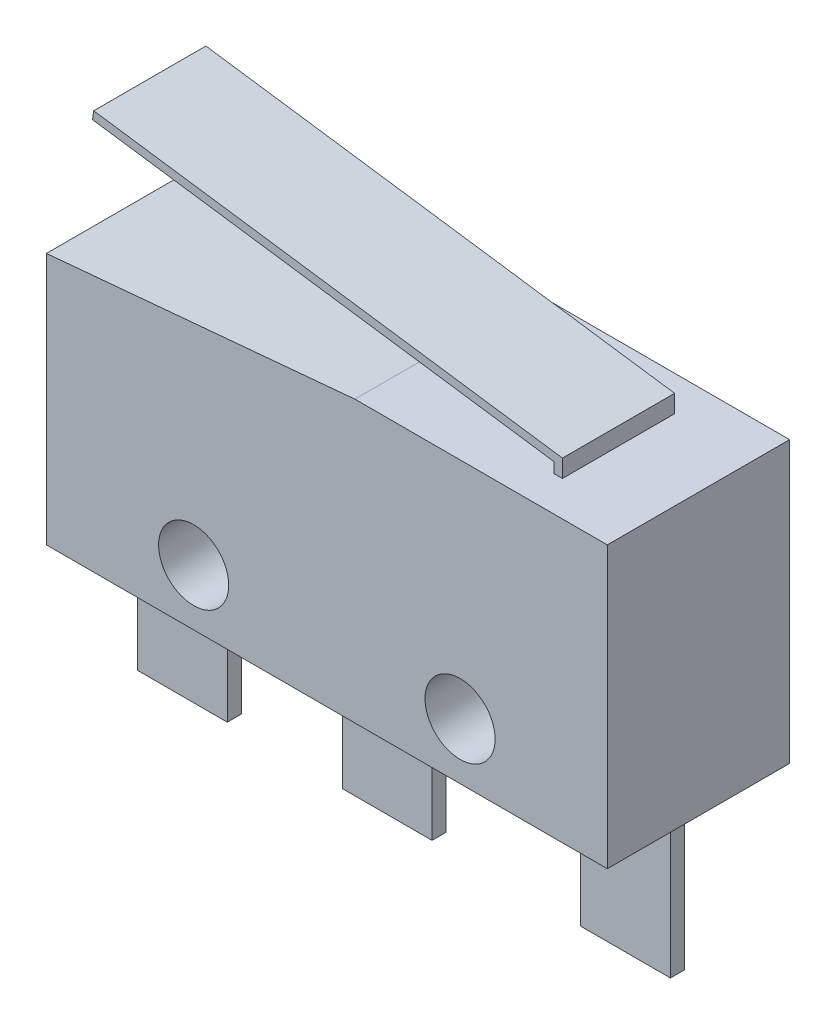
ISO-10303-21;
HEADER;
FILE_DESCRIPTION(('STEP AP214'),'2;1');
FILE_NAME('part.step','',(''),(''),'','','');
FILE_SCHEMA(('AUTOMOTIVE_DESIGN { 1 0 10303 214 1 1 1 1 }'));
ENDSEC;
DATA;
#1=APPLICATION_CONTEXT('core data for automotive mechanical design processes');
#2=APPLICATION_PROTOCOL_DEFINITION('international standard','automotive_design',2000,#1);
#3=PRODUCT_CONTEXT('',#1,'mechanical');
#4=PRODUCT('Part','Part','',(#3));
#5=PRODUCT_RELATED_PRODUCT_CATEGORY('part','',(#4));
#6=PRODUCT_DEFINITION_FORMATION('','',#4);
#7=PRODUCT_DEFINITION_CONTEXT('part definition',#1,'design');
#8=PRODUCT_DEFINITION('design','',#6,#7);
#9=PRODUCT_DEFINITION_SHAPE('','',#8);
#10=(LENGTH_UNIT() NAMED_UNIT(*) SI_UNIT(.MILLI.,.METRE.));
#11=(NAMED_UNIT(*) PLANE_ANGLE_UNIT() SI_UNIT($,.RADIAN.));
#12=(NAMED_UNIT(*) SI_UNIT($,.STERADIAN.) SOLID_ANGLE_UNIT());
#13=UNCERTAINTY_MEASURE_WITH_UNIT(LENGTH_MEASURE(1.E-05),#10,'distance_accuracy_value','');
#14=(GEOMETRIC_REPRESENTATION_CONTEXT(3) GLOBAL_UNCERTAINTY_ASSIGNED_CONTEXT((#13)) GLOBAL_UNIT_ASSIGNED_CONTEXT((#10,
#11,#12)) REPRESENTATION_CONTEXT('',''));
#15=CARTESIAN_POINT('',(0.,0.,0.));
#16=DIRECTION('',(0.,0.,1.));
#17=DIRECTION('',(1.,0.,0.));
#18=AXIS2_PLACEMENT_3D('',#15,#16,#17);
#19=CARTESIAN_POINT('',(-10.,10.,3.25));
#20=DIRECTION('',(0.,-1.,0.));
#21=DIRECTION('',(0.,0.,-1.));
#22=AXIS2_PLACEMENT_3D('',#19,#20,#21);
#23=PLANE('',#22);
#24=DIRECTION('',(1.,0.,0.));
#25=VECTOR('',#24,1.);
#26=CARTESIAN_POINT('',(2.00000000000001,10.,1.));
#27=LINE('',#26,#25);
#28=CARTESIAN_POINT('',(2.00000000000001,10.,1.));
#29=VERTEX_POINT('',#28);
#30=CARTESIAN_POINT('',(4.00000000000001,10.,1.));
#31=VERTEX_POINT('',#30);
#32=EDGE_CURVE('E401',#29,#31,#27,.T.);
#33=ORIENTED_EDGE('',*,*,#32,.F.);
#34=DIRECTION('',(0.,0.,-1.));
#35=VECTOR('',#34,1.);
#36=CARTESIAN_POINT('',(2.00000000000001,10.,1.));
#37=LINE('',#36,#35);
#38=CARTESIAN_POINT('',(2.00000000000001,10.,-1.));
#39=VERTEX_POINT('',#38);
#40=EDGE_CURVE('E421',#29,#39,#37,.T.);
#41=ORIENTED_EDGE('',*,*,#40,.T.);
#42=DIRECTION('',(1.,0.,0.));
#43=VECTOR('',#42,1.);
#44=CARTESIAN_POINT('',(2.00000000000001,10.,-1.));
#45=LINE('',#44,#43);
#46=CARTESIAN_POINT('',(4.00000000000001,10.,-1.));
#47=VERTEX_POINT('',#46);
#48=EDGE_CURVE('E409',#39,#47,#45,.T.);
#49=ORIENTED_EDGE('',*,*,#48,.T.);
#50=DIRECTION('',(0.,0.,-1.));
#51=VECTOR('',#50,1.);
#52=CARTESIAN_POINT('',(4.00000000000001,10.,1.));
#53=LINE('',#52,#51);
#54=EDGE_CURVE('E418',#31,#47,#53,.T.);
#55=ORIENTED_EDGE('',*,*,#54,.F.);
#56=EDGE_LOOP('',(#33,#41,#49,#55));
#57=FACE_BOUND('',#56,.T.);
#58=DIRECTION('',(-1.,0.,0.));
#59=VECTOR('',#58,1.);
#60=CARTESIAN_POINT('',(-10.,10.,-3.25));
#61=LINE('',#60,#59);
#62=CARTESIAN_POINT('',(10.,10.,-3.25));
#63=VERTEX_POINT('',#62);
#64=CARTESIAN_POINT('',(1.00000000000002,10.,-3.25));
#65=VERTEX_POINT('',#64);
#66=EDGE_CURVE('E438',#63,#65,#61,.T.);
#67=ORIENTED_EDGE('',*,*,#66,.T.);
#68=DIRECTION('',(0.,0.,1.));
#69=VECTOR('',#68,1.);
#70=CARTESIAN_POINT('',(1.00000000000001,10.,-3.25));
#71=LINE('',#70,#69);
#72=CARTESIAN_POINT('',(1.00000000000001,10.,3.25));
#73=VERTEX_POINT('',#72);
#74=EDGE_CURVE('E430',#65,#73,#71,.T.);
#75=ORIENTED_EDGE('',*,*,#74,.T.);
#76=DIRECTION('',(-1.,0.,0.));
#77=VECTOR('',#76,1.);
#78=CARTESIAN_POINT('',(-10.,10.,3.25));
#79=LINE('',#78,#77);
#80=CARTESIAN_POINT('',(10.,10.,3.25));
#81=VERTEX_POINT('',#80);
#82=EDGE_CURVE('E442',#81,#73,#79,.T.);
#83=ORIENTED_EDGE('',*,*,#82,.F.);
#84=DIRECTION('',(0.,0.,-1.));
#85=VECTOR('',#84,1.);
#86=CARTESIAN_POINT('',(10.,10.,3.25));
#87=LINE('',#86,#85);
#88=EDGE_CURVE('E445',#81,#63,#87,.T.);
#89=ORIENTED_EDGE('',*,*,#88,.T.);
#90=EDGE_LOOP('',(#67,#75,#83,#89));
#91=FACE_BOUND('',#90,.T.);
#92=DIRECTION('',(-1.,0.,0.));
#93=VECTOR('',#92,1.);
#94=CARTESIAN_POINT('',(7.15000000000001,10.,2.));
#95=LINE('',#94,#93);
#96=CARTESIAN_POINT('',(7.15000000000001,10.,2.));
#97=VERTEX_POINT('',#96);
#98=CARTESIAN_POINT('',(6.85000000000001,10.,2.));
#99=VERTEX_POINT('',#98);
#100=EDGE_CURVE('E256',#97,#99,#95,.T.);
#101=ORIENTED_EDGE('',*,*,#100,.T.);
#102=DIRECTION('',(0.,0.,-1.));
#103=VECTOR('',#102,1.);
#104=CARTESIAN_POINT('',(6.85000000000001,10.,2.));
#105=LINE('',#104,#103);
#106=CARTESIAN_POINT('',(6.85000000000001,10.,-2.));
#107=VERTEX_POINT('',#106);
#108=EDGE_CURVE('E276',#99,#107,#105,.T.);
#109=ORIENTED_EDGE('',*,*,#108,.T.);
#110=DIRECTION('',(-1.,0.,0.));
#111=VECTOR('',#110,1.);
#112=CARTESIAN_POINT('',(7.15000000000001,10.,-2.));
#113=LINE('',#112,#111);
#114=CARTESIAN_POINT('',(7.15000000000001,10.,-2.));
#115=VERTEX_POINT('',#114);
#116=EDGE_CURVE('E270',#115,#107,#113,.T.);
#117=ORIENTED_EDGE('',*,*,#116,.F.);
#118=DIRECTION('',(0.,0.,-1.));
#119=VECTOR('',#118,1.);
#120=CARTESIAN_POINT('',(7.15000000000001,10.,2.));
#121=LINE('',#120,#119);
#122=EDGE_CURVE('E274',#97,#115,#121,.T.);
#123=ORIENTED_EDGE('',*,*,#122,.F.);
#124=EDGE_LOOP('',(#101,#109,#117,#123));
#125=FACE_BOUND('',#124,.T.);
#126=ADVANCED_FACE('F33',(#57,#91,#125),#23,.F.);
#127=CARTESIAN_POINT('',(3.00000000000001,9.96666666666667,1.));
#128=DIRECTION('',(0.,0.,-1.));
#129=DIRECTION('',(-1.,0.,0.));
#130=AXIS2_PLACEMENT_3D('',#127,#128,#129);
#131=CYLINDRICAL_SURFACE('',#130,1.13333333333333);
#132=CARTESIAN_POINT('',(3.00000000000001,9.96666666666667,1.));
#133=DIRECTION('',(0.,0.,1.));
#134=DIRECTION('',(-1.,0.,0.));
#135=AXIS2_PLACEMENT_3D('',#132,#133,#134);
#136=CIRCLE('',#135,1.13333333333333);
#137=CARTESIAN_POINT('',(2.50381724234199,10.9856107845884,1.));
#138=VERTEX_POINT('',#137);
#139=CARTESIAN_POINT('',(2.00000000000001,10.5,1.));
#140=VERTEX_POINT('',#139);
#141=EDGE_CURVE('E395',#138,#140,#136,.T.);
#142=ORIENTED_EDGE('',*,*,#141,.F.);
#143=DIRECTION('',(0.,0.,-1.));
#144=VECTOR('',#143,1.);
#145=CARTESIAN_POINT('',(2.503817242342,10.9856107845884,1.));
#146=LINE('',#145,#144);
#147=CARTESIAN_POINT('',(2.50381724234199,10.9856107845884,-1.));
#148=VERTEX_POINT('',#147);
#149=EDGE_CURVE('E11',#138,#148,#146,.T.);
#150=ORIENTED_EDGE('',*,*,#149,.T.);
#151=CARTESIAN_POINT('',(3.00000000000001,9.96666666666667,-1.));
#152=DIRECTION('',(0.,0.,1.));
#153=DIRECTION('',(-1.,0.,0.));
#154=AXIS2_PLACEMENT_3D('',#151,#152,#153);
#155=CIRCLE('',#154,1.13333333333333);
#156=CARTESIAN_POINT('',(2.00000000000001,10.5,-1.));
#157=VERTEX_POINT('',#156);
#158=EDGE_CURVE('E388',#148,#157,#155,.T.);
#159=ORIENTED_EDGE('',*,*,#158,.T.);
#160=DIRECTION('',(0.,0.,-1.));
#161=VECTOR('',#160,1.);
#162=CARTESIAN_POINT('',(2.00000000000001,10.5,1.));
#163=LINE('',#162,#161);
#164=EDGE_CURVE('E406',#140,#157,#163,.T.);
#165=ORIENTED_EDGE('',*,*,#164,.F.);
#166=EDGE_LOOP('',(#142,#150,#159,#165));
#167=FACE_BOUND('',#166,.T.);
#168=ADVANCED_FACE('F480',(#167),#131,.T.);
#169=CARTESIAN_POINT('',(-10.,10.,3.25));
#170=DIRECTION('',(1.,0.,0.));
#171=DIRECTION('',(0.,1.,0.));
#172=AXIS2_PLACEMENT_3D('',#169,#170,#171);
#173=PLANE('',#172);
#174=DIRECTION('',(0.,-1.,0.));
#175=VECTOR('',#174,1.);
#176=CARTESIAN_POINT('',(-10.,10.,3.25));
#177=LINE('',#176,#175);
#178=CARTESIAN_POINT('',(-10.,9.,3.25));
#179=VERTEX_POINT('',#178);
#180=CARTESIAN_POINT('',(-10.,0.,3.25));
#181=VERTEX_POINT('',#180);
#182=EDGE_CURVE('E435',#179,#181,#177,.T.);
#183=ORIENTED_EDGE('',*,*,#182,.F.);
#184=DIRECTION('',(0.,0.,1.));
#185=VECTOR('',#184,1.);
#186=CARTESIAN_POINT('',(-10.,9.,-3.25));
#187=LINE('',#186,#185);
#188=CARTESIAN_POINT('',(-10.,9.,-3.25));
#189=VERTEX_POINT('',#188);
#190=EDGE_CURVE('E428',#189,#179,#187,.T.);
#191=ORIENTED_EDGE('',*,*,#190,.F.);
#192=DIRECTION('',(0.,-1.,0.));
#193=VECTOR('',#192,1.);
#194=CARTESIAN_POINT('',(-10.,10.,-3.25));
#195=LINE('',#194,#193);
#196=CARTESIAN_POINT('',(-10.,0.,-3.25));
#197=VERTEX_POINT('',#196);
#198=EDGE_CURVE('E433',#189,#197,#195,.T.);
#199=ORIENTED_EDGE('',*,*,#198,.T.);
#200=DIRECTION('',(0.,0.,-1.));
#201=VECTOR('',#200,1.);
#202=CARTESIAN_POINT('',(-10.,0.,3.25));
#203=LINE('',#202,#201);
#204=EDGE_CURVE('E458',#181,#197,#203,.T.);
#205=ORIENTED_EDGE('',*,*,#204,.F.);
#206=EDGE_LOOP('',(#183,#191,#199,#205));
#207=FACE_BOUND('',#206,.T.);
#208=ADVANCED_FACE('F35',(#207),#173,.F.);
#209=CARTESIAN_POINT('',(-10.,0.,3.25));
#210=DIRECTION('',(0.,1.,0.));
#211=DIRECTION('',(0.,0.,1.));
#212=AXIS2_PLACEMENT_3D('',#209,#210,#211);
#213=PLANE('',#212);
#214=DIRECTION('',(0.,0.,-1.));
#215=VECTOR('',#214,1.);
#216=CARTESIAN_POINT('',(-2.19999999999999,0.,0.5));
#217=LINE('',#216,#215);
#218=CARTESIAN_POINT('',(-2.19999999999999,0.,0.5));
#219=VERTEX_POINT('',#218);
#220=CARTESIAN_POINT('',(-2.19999999999999,0.,0.));
#221=VERTEX_POINT('',#220);
#222=EDGE_CURVE('E297',#219,#221,#217,.T.);
#223=ORIENTED_EDGE('',*,*,#222,.F.);
#224=DIRECTION('',(-1.,0.,0.));
#225=VECTOR('',#224,1.);
#226=CARTESIAN_POINT('',(-2.19999999999999,0.,0.5));
#227=LINE('',#226,#225);
#228=CARTESIAN_POINT('',(1.00000000000001,0.,0.5));
#229=VERTEX_POINT('',#228);
#230=EDGE_CURVE('E294',#229,#219,#227,.T.);
#231=ORIENTED_EDGE('',*,*,#230,.F.);
#232=DIRECTION('',(0.,0.,-1.));
#233=VECTOR('',#232,1.);
#234=CARTESIAN_POINT('',(1.00000000000001,0.,0.5));
#235=LINE('',#234,#233);
#236=CARTESIAN_POINT('',(1.00000000000001,0.,0.));
#237=VERTEX_POINT('',#236);
#238=EDGE_CURVE('E308',#229,#237,#235,.T.);
#239=ORIENTED_EDGE('',*,*,#238,.T.);
#240=DIRECTION('',(-1.,0.,0.));
#241=VECTOR('',#240,1.);
#242=CARTESIAN_POINT('',(-2.19999999999999,0.,0.));
#243=LINE('',#242,#241);
#244=EDGE_CURVE('E289',#237,#221,#243,.T.);
#245=ORIENTED_EDGE('',*,*,#244,.T.);
#246=EDGE_LOOP('',(#223,#231,#239,#245));
#247=FACE_BOUND('',#246,.T.);
#248=DIRECTION('',(0.,0.,-1.));
#249=VECTOR('',#248,1.);
#250=CARTESIAN_POINT('',(6.3,0.,0.5));
#251=LINE('',#250,#249);
#252=CARTESIAN_POINT('',(6.3,0.,0.5));
#253=VERTEX_POINT('',#252);
#254=CARTESIAN_POINT('',(6.30000000000001,0.,0.));
#255=VERTEX_POINT('',#254);
#256=EDGE_CURVE('E343',#253,#255,#251,.T.);
#257=ORIENTED_EDGE('',*,*,#256,.F.);
#258=DIRECTION('',(-1.,0.,0.));
#259=VECTOR('',#258,1.);
#260=CARTESIAN_POINT('',(9.5,0.,0.5));
#261=LINE('',#260,#259);
#262=CARTESIAN_POINT('',(9.5,0.,0.5));
#263=VERTEX_POINT('',#262);
#264=EDGE_CURVE('E317',#263,#253,#261,.T.);
#265=ORIENTED_EDGE('',*,*,#264,.F.);
#266=DIRECTION('',(0.,0.,-1.));
#267=VECTOR('',#266,1.);
#268=CARTESIAN_POINT('',(9.5,0.,0.5));
#269=LINE('',#268,#267);
#270=CARTESIAN_POINT('',(9.5,0.,0.));
#271=VERTEX_POINT('',#270);
#272=EDGE_CURVE('E328',#263,#271,#269,.T.);
#273=ORIENTED_EDGE('',*,*,#272,.T.);
#274=DIRECTION('',(-1.,0.,0.));
#275=VECTOR('',#274,1.);
#276=CARTESIAN_POINT('',(9.5,0.,0.));
#277=LINE('',#276,#275);
#278=EDGE_CURVE('E316',#271,#255,#277,.T.);
#279=ORIENTED_EDGE('',*,*,#278,.T.);
#280=EDGE_LOOP('',(#257,#265,#273,#279));
#281=FACE_BOUND('',#280,.T.);
#282=DIRECTION('',(0.,0.,-1.));
#283=VECTOR('',#282,1.);
#284=CARTESIAN_POINT('',(-9.5,0.,0.5));
#285=LINE('',#284,#283);
#286=CARTESIAN_POINT('',(-9.5,0.,0.5));
#287=VERTEX_POINT('',#286);
#288=CARTESIAN_POINT('',(-9.5,0.,0.));
#289=VERTEX_POINT('',#288);
#290=EDGE_CURVE('E359',#287,#289,#285,.T.);
#291=ORIENTED_EDGE('',*,*,#290,.F.);
#292=DIRECTION('',(-1.,0.,0.));
#293=VECTOR('',#292,1.);
#294=CARTESIAN_POINT('',(-9.5,0.,0.5));
#295=LINE('',#294,#293);
#296=CARTESIAN_POINT('',(-6.3,0.,0.5));
#297=VERTEX_POINT('',#296);
#298=EDGE_CURVE('E356',#297,#287,#295,.T.);
#299=ORIENTED_EDGE('',*,*,#298,.F.);
#300=DIRECTION('',(0.,0.,-1.));
#301=VECTOR('',#300,1.);
#302=CARTESIAN_POINT('',(-6.3,0.,0.5));
#303=LINE('',#302,#301);
#304=CARTESIAN_POINT('',(-6.3,0.,0.));
#305=VERTEX_POINT('',#304);
#306=EDGE_CURVE('E370',#297,#305,#303,.T.);
#307=ORIENTED_EDGE('',*,*,#306,.T.);
#308=DIRECTION('',(-1.,0.,0.));
#309=VECTOR('',#308,1.);
#310=CARTESIAN_POINT('',(-9.5,0.,0.));
#311=LINE('',#310,#309);
#312=EDGE_CURVE('E351',#305,#289,#311,.T.);
#313=ORIENTED_EDGE('',*,*,#312,.T.);
#314=EDGE_LOOP('',(#291,#299,#307,#313));
#315=FACE_BOUND('',#314,.T.);
#316=DIRECTION('',(1.,0.,0.));
#317=VECTOR('',#316,1.);
#318=CARTESIAN_POINT('',(-10.,0.,-3.25));
#319=LINE('',#318,#317);
#320=CARTESIAN_POINT('',(10.,0.,-3.25));
#321=VERTEX_POINT('',#320);
#322=EDGE_CURVE('E447',#197,#321,#319,.T.);
#323=ORIENTED_EDGE('',*,*,#322,.T.);
#324=DIRECTION('',(0.,0.,-1.));
#325=VECTOR('',#324,1.);
#326=CARTESIAN_POINT('',(10.,0.,3.25));
#327=LINE('',#326,#325);
#328=CARTESIAN_POINT('',(10.,0.,3.25));
#329=VERTEX_POINT('',#328);
#330=EDGE_CURVE('E455',#329,#321,#327,.T.);
#331=ORIENTED_EDGE('',*,*,#330,.F.);
#332=DIRECTION('',(1.,0.,0.));
#333=VECTOR('',#332,1.);
#334=CARTESIAN_POINT('',(-10.,0.,3.25));
#335=LINE('',#334,#333);
#336=EDGE_CURVE('E437',#181,#329,#335,.T.);
#337=ORIENTED_EDGE('',*,*,#336,.F.);
#338=ORIENTED_EDGE('',*,*,#204,.T.);
#339=EDGE_LOOP('',(#323,#331,#337,#338));
#340=FACE_BOUND('',#339,.T.);
#341=ADVANCED_FACE('F611',(#247,#281,#315,#340),#213,.F.);
#342=CARTESIAN_POINT('',(10.,10.,3.25));
#343=DIRECTION('',(-1.,0.,0.));
#344=DIRECTION('',(0.,-1.,0.));
#345=AXIS2_PLACEMENT_3D('',#342,#343,#344);
#346=PLANE('',#345);
#347=DIRECTION('',(0.,1.,0.));
#348=VECTOR('',#347,1.);
#349=CARTESIAN_POINT('',(10.,10.,-3.25));
#350=LINE('',#349,#348);
#351=EDGE_CURVE('E449',#321,#63,#350,.T.);
#352=ORIENTED_EDGE('',*,*,#351,.T.);
#353=ORIENTED_EDGE('',*,*,#88,.F.);
#354=DIRECTION('',(0.,1.,0.));
#355=VECTOR('',#354,1.);
#356=CARTESIAN_POINT('',(10.,10.,3.25));
#357=LINE('',#356,#355);
#358=EDGE_CURVE('E440',#329,#81,#357,.T.);
#359=ORIENTED_EDGE('',*,*,#358,.F.);
#360=ORIENTED_EDGE('',*,*,#330,.T.);
#361=EDGE_LOOP('',(#352,#353,#359,#360));
#362=FACE_BOUND('',#361,.T.);
#363=ADVANCED_FACE('F605',(#362),#346,.F.);
#364=CARTESIAN_POINT('',(-10.,0.,3.25));
#365=DIRECTION('',(0.,0.,1.));
#366=DIRECTION('',(1.,0.,0.));
#367=AXIS2_PLACEMENT_3D('',#364,#365,#366);
#368=PLANE('',#367);
#369=CARTESIAN_POINT('',(4.75,2.,3.25));
#370=DIRECTION('',(0.,0.,1.));
#371=DIRECTION('',(1.,0.,0.));
#372=AXIS2_PLACEMENT_3D('',#369,#370,#371);
#373=CIRCLE('',#372,1.25);
#374=CARTESIAN_POINT('',(6.,2.,3.25));
#375=VERTEX_POINT('',#374);
#376=EDGE_CURVE('E378',#375,#375,#373,.T.);
#377=ORIENTED_EDGE('',*,*,#376,.F.);
#378=EDGE_LOOP('',(#377));
#379=FACE_BOUND('',#378,.T.);
#380=CARTESIAN_POINT('',(-4.75,2.,3.25));
#381=DIRECTION('',(0.,0.,1.));
#382=DIRECTION('',(1.,0.,0.));
#383=AXIS2_PLACEMENT_3D('',#380,#381,#382);
#384=CIRCLE('',#383,1.25);
#385=CARTESIAN_POINT('',(-3.5,2.,3.25));
#386=VERTEX_POINT('',#385);
#387=EDGE_CURVE('E382',#386,#386,#384,.T.);
#388=ORIENTED_EDGE('',*,*,#387,.F.);
#389=EDGE_LOOP('',(#388));
#390=FACE_BOUND('',#389,.T.);
#391=DIRECTION('',(0.995893206467704,0.0905357460425185,0.));
#392=VECTOR('',#391,1.);
#393=CARTESIAN_POINT('',(1.00000000000001,10.,3.25));
#394=LINE('',#393,#392);
#395=EDGE_CURVE('E424',#179,#73,#394,.T.);
#396=ORIENTED_EDGE('',*,*,#395,.F.);
#397=ORIENTED_EDGE('',*,*,#182,.T.);
#398=ORIENTED_EDGE('',*,*,#336,.T.);
#399=ORIENTED_EDGE('',*,*,#358,.T.);
#400=ORIENTED_EDGE('',*,*,#82,.T.);
#401=EDGE_LOOP('',(#396,#397,#398,#399,#400));
#402=FACE_BOUND('',#401,.T.);
#403=ADVANCED_FACE('F602',(#379,#390,#402),#368,.T.);
#404=CARTESIAN_POINT('',(-10.,0.,-3.25));
#405=DIRECTION('',(0.,0.,1.));
#406=DIRECTION('',(1.,0.,0.));
#407=AXIS2_PLACEMENT_3D('',#404,#405,#406);
#408=PLANE('',#407);
#409=CARTESIAN_POINT('',(4.75,2.,-3.25));
#410=DIRECTION('',(0.,0.,1.));
#411=DIRECTION('',(1.,0.,0.));
#412=AXIS2_PLACEMENT_3D('',#409,#410,#411);
#413=CIRCLE('',#412,1.25);
#414=CARTESIAN_POINT('',(6.,2.,-3.25));
#415=VERTEX_POINT('',#414);
#416=EDGE_CURVE('E379',#415,#415,#413,.T.);
#417=ORIENTED_EDGE('',*,*,#416,.T.);
#418=EDGE_LOOP('',(#417));
#419=FACE_BOUND('',#418,.T.);
#420=CARTESIAN_POINT('',(-4.75,2.,-3.25));
#421=DIRECTION('',(0.,0.,1.));
#422=DIRECTION('',(1.,0.,0.));
#423=AXIS2_PLACEMENT_3D('',#420,#421,#422);
#424=CIRCLE('',#423,1.25);
#425=CARTESIAN_POINT('',(-3.5,2.,-3.25));
#426=VERTEX_POINT('',#425);
#427=EDGE_CURVE('E385',#426,#426,#424,.T.);
#428=ORIENTED_EDGE('',*,*,#427,.T.);
#429=EDGE_LOOP('',(#428));
#430=FACE_BOUND('',#429,.T.);
#431=ORIENTED_EDGE('',*,*,#198,.F.);
#432=DIRECTION('',(0.995893206467704,0.0905357460425185,0.));
#433=VECTOR('',#432,1.);
#434=CARTESIAN_POINT('',(1.00000000000001,10.,-3.25));
#435=LINE('',#434,#433);
#436=EDGE_CURVE('E425',#189,#65,#435,.T.);
#437=ORIENTED_EDGE('',*,*,#436,.T.);
#438=ORIENTED_EDGE('',*,*,#66,.F.);
#439=ORIENTED_EDGE('',*,*,#351,.F.);
#440=ORIENTED_EDGE('',*,*,#322,.F.);
#441=EDGE_LOOP('',(#431,#437,#438,#439,#440));
#442=FACE_BOUND('',#441,.T.);
#443=ADVANCED_FACE('F600',(#419,#430,#442),#408,.F.);
#444=CARTESIAN_POINT('',(1.00000000000001,10.,-3.25));
#445=DIRECTION('',(0.0905357460425185,-0.995893206467704,0.));
#446=DIRECTION('',(0.995893206467704,0.0905357460425185,0.));
#447=AXIS2_PLACEMENT_3D('',#444,#445,#446);
#448=PLANE('',#447);
#449=ORIENTED_EDGE('',*,*,#395,.T.);
#450=ORIENTED_EDGE('',*,*,#74,.F.);
#451=ORIENTED_EDGE('',*,*,#436,.F.);
#452=ORIENTED_EDGE('',*,*,#190,.T.);
#453=EDGE_LOOP('',(#449,#450,#451,#452));
#454=FACE_BOUND('',#453,.T.);
#455=ADVANCED_FACE('F597',(#454),#448,.F.);
#456=CARTESIAN_POINT('',(2.00000000000001,10.,1.));
#457=DIRECTION('',(1.,0.,0.));
#458=DIRECTION('',(0.,0.,-1.));
#459=AXIS2_PLACEMENT_3D('',#456,#457,#458);
#460=PLANE('',#459);
#461=DIRECTION('',(0.,-1.,0.));
#462=VECTOR('',#461,1.);
#463=CARTESIAN_POINT('',(2.00000000000001,10.,-1.));
#464=LINE('',#463,#462);
#465=EDGE_CURVE('E394',#157,#39,#464,.T.);
#466=ORIENTED_EDGE('',*,*,#465,.T.);
#467=ORIENTED_EDGE('',*,*,#40,.F.);
#468=DIRECTION('',(0.,-1.,0.));
#469=VECTOR('',#468,1.);
#470=CARTESIAN_POINT('',(2.00000000000001,10.,1.));
#471=LINE('',#470,#469);
#472=EDGE_CURVE('E399',#140,#29,#471,.T.);
#473=ORIENTED_EDGE('',*,*,#472,.F.);
#474=ORIENTED_EDGE('',*,*,#164,.T.);
#475=EDGE_LOOP('',(#466,#467,#473,#474));
#476=FACE_BOUND('',#475,.T.);
#477=ADVANCED_FACE('F485',(#476),#460,.F.);
#478=CARTESIAN_POINT('',(4.00000000000001,10.,1.));
#479=DIRECTION('',(-1.,0.,0.));
#480=DIRECTION('',(0.,0.,1.));
#481=AXIS2_PLACEMENT_3D('',#478,#479,#480);
#482=PLANE('',#481);
#483=DIRECTION('',(0.,1.,0.));
#484=VECTOR('',#483,1.);
#485=CARTESIAN_POINT('',(4.00000000000001,10.,-1.));
#486=LINE('',#485,#484);
#487=CARTESIAN_POINT('',(4.00000000000001,10.5,-1.));
#488=VERTEX_POINT('',#487);
#489=EDGE_CURVE('E402',#47,#488,#486,.T.);
#490=ORIENTED_EDGE('',*,*,#489,.T.);
#491=DIRECTION('',(0.,0.,-1.));
#492=VECTOR('',#491,1.);
#493=CARTESIAN_POINT('',(4.00000000000001,10.5,1.));
#494=LINE('',#493,#492);
#495=CARTESIAN_POINT('',(4.00000000000001,10.5,1.));
#496=VERTEX_POINT('',#495);
#497=EDGE_CURVE('E415',#496,#488,#494,.T.);
#498=ORIENTED_EDGE('',*,*,#497,.F.);
#499=DIRECTION('',(0.,1.,0.));
#500=VECTOR('',#499,1.);
#501=CARTESIAN_POINT('',(4.00000000000001,10.,1.));
#502=LINE('',#501,#500);
#503=EDGE_CURVE('E404',#31,#496,#502,.T.);
#504=ORIENTED_EDGE('',*,*,#503,.F.);
#505=ORIENTED_EDGE('',*,*,#54,.T.);
#506=EDGE_LOOP('',(#490,#498,#504,#505));
#507=FACE_BOUND('',#506,.T.);
#508=ADVANCED_FACE('F473',(#507),#482,.F.);
#509=CARTESIAN_POINT('',(2.00000000000001,10.5,1.));
#510=DIRECTION('',(0.,0.,-1.));
#511=DIRECTION('',(-1.,0.,0.));
#512=AXIS2_PLACEMENT_3D('',#509,#510,#511);
#513=PLANE('',#512);
#514=CARTESIAN_POINT('',(3.75973414846379,10.8076473252448,1.));
#515=VERTEX_POINT('',#514);
#516=EDGE_CURVE('E391',#496,#515,#136,.T.);
#517=ORIENTED_EDGE('',*,*,#516,.T.);
#518=DIRECTION('',(-0.990109250943421,0.140298507462686,0.));
#519=VECTOR('',#518,1.);
#520=CARTESIAN_POINT('',(2.07737357986189,11.0460378630203,1.));
#521=LINE('',#520,#519);
#522=EDGE_CURVE('E56',#515,#138,#521,.T.);
#523=ORIENTED_EDGE('',*,*,#522,.T.);
#524=ORIENTED_EDGE('',*,*,#141,.T.);
#525=ORIENTED_EDGE('',*,*,#472,.T.);
#526=ORIENTED_EDGE('',*,*,#32,.T.);
#527=ORIENTED_EDGE('',*,*,#503,.T.);
#528=EDGE_LOOP('',(#517,#523,#524,#525,#526,#527));
#529=FACE_BOUND('',#528,.T.);
#530=ADVANCED_FACE('F466',(#529),#513,.F.);
#531=CARTESIAN_POINT('',(2.00000000000001,10.5,-1.));
#532=DIRECTION('',(0.,0.,-1.));
#533=DIRECTION('',(-1.,0.,0.));
#534=AXIS2_PLACEMENT_3D('',#531,#532,#533);
#535=PLANE('',#534);
#536=DIRECTION('',(-0.990109250943421,0.140298507462686,0.));
#537=VECTOR('',#536,1.);
#538=CARTESIAN_POINT('',(2.07737357986189,11.0460378630203,-1.));
#539=LINE('',#538,#537);
#540=CARTESIAN_POINT('',(3.75973414846379,10.8076473252448,-1.));
#541=VERTEX_POINT('',#540);
#542=EDGE_CURVE('E245',#541,#148,#539,.T.);
#543=ORIENTED_EDGE('',*,*,#542,.F.);
#544=EDGE_CURVE('E396',#488,#541,#155,.T.);
#545=ORIENTED_EDGE('',*,*,#544,.F.);
#546=ORIENTED_EDGE('',*,*,#489,.F.);
#547=ORIENTED_EDGE('',*,*,#48,.F.);
#548=ORIENTED_EDGE('',*,*,#465,.F.);
#549=ORIENTED_EDGE('',*,*,#158,.F.);
#550=EDGE_LOOP('',(#543,#545,#546,#547,#548,#549));
#551=FACE_BOUND('',#550,.T.);
#552=ADVANCED_FACE('F475',(#551),#535,.T.);
#553=ORIENTED_EDGE('',*,*,#544,.T.);
#554=DIRECTION('',(0.,0.,-1.));
#555=VECTOR('',#554,1.);
#556=CARTESIAN_POINT('',(3.75973414846379,10.8076473252448,1.));
#557=LINE('',#556,#555);
#558=EDGE_CURVE('E41',#541,#515,#557,.F.);
#559=ORIENTED_EDGE('',*,*,#558,.T.);
#560=ORIENTED_EDGE('',*,*,#516,.F.);
#561=ORIENTED_EDGE('',*,*,#497,.T.);
#562=EDGE_LOOP('',(#553,#559,#560,#561));
#563=FACE_BOUND('',#562,.T.);
#564=ADVANCED_FACE('F462',(#563),#131,.T.);
#565=CARTESIAN_POINT('',(-4.75,2.,-3.25));
#566=DIRECTION('',(0.,0.,1.));
#567=DIRECTION('',(1.,0.,0.));
#568=AXIS2_PLACEMENT_3D('',#565,#566,#567);
#569=CYLINDRICAL_SURFACE('',#568,1.25);
#570=ORIENTED_EDGE('',*,*,#427,.F.);
#571=EDGE_LOOP('',(#570));
#572=FACE_BOUND('',#571,.T.);
#573=ORIENTED_EDGE('',*,*,#387,.T.);
#574=EDGE_LOOP('',(#573));
#575=FACE_BOUND('',#574,.T.);
#576=ADVANCED_FACE('F582',(#572,#575),#569,.F.);
#577=CARTESIAN_POINT('',(4.75,2.,-3.25));
#578=DIRECTION('',(0.,0.,1.));
#579=DIRECTION('',(1.,0.,0.));
#580=AXIS2_PLACEMENT_3D('',#577,#578,#579);
#581=CYLINDRICAL_SURFACE('',#580,1.25);
#582=ORIENTED_EDGE('',*,*,#416,.F.);
#583=EDGE_LOOP('',(#582));
#584=FACE_BOUND('',#583,.T.);
#585=ORIENTED_EDGE('',*,*,#376,.T.);
#586=EDGE_LOOP('',(#585));
#587=FACE_BOUND('',#586,.T.);
#588=ADVANCED_FACE('F578',(#584,#587),#581,.F.);
#589=CARTESIAN_POINT('',(-9.5,0.,0.5));
#590=DIRECTION('',(1.,0.,0.));
#591=DIRECTION('',(0.,1.,0.));
#592=AXIS2_PLACEMENT_3D('',#589,#590,#591);
#593=PLANE('',#592);
#594=DIRECTION('',(0.,-1.,0.));
#595=VECTOR('',#594,1.);
#596=CARTESIAN_POINT('',(-9.5,0.,0.));
#597=LINE('',#596,#595);
#598=CARTESIAN_POINT('',(-9.5,-5.,0.));
#599=VERTEX_POINT('',#598);
#600=EDGE_CURVE('E346',#289,#599,#597,.T.);
#601=ORIENTED_EDGE('',*,*,#600,.T.);
#602=DIRECTION('',(0.,0.,-1.));
#603=VECTOR('',#602,1.);
#604=CARTESIAN_POINT('',(-9.5,-5.,0.5));
#605=LINE('',#604,#603);
#606=CARTESIAN_POINT('',(-9.5,-5.,0.5));
#607=VERTEX_POINT('',#606);
#608=EDGE_CURVE('E375',#607,#599,#605,.T.);
#609=ORIENTED_EDGE('',*,*,#608,.F.);
#610=DIRECTION('',(0.,-1.,0.));
#611=VECTOR('',#610,1.);
#612=CARTESIAN_POINT('',(-9.5,0.,0.5));
#613=LINE('',#612,#611);
#614=EDGE_CURVE('E347',#287,#607,#613,.T.);
#615=ORIENTED_EDGE('',*,*,#614,.F.);
#616=ORIENTED_EDGE('',*,*,#290,.T.);
#617=EDGE_LOOP('',(#601,#609,#615,#616));
#618=FACE_BOUND('',#617,.T.);
#619=ADVANCED_FACE('F574',(#618),#593,.F.);
#620=CARTESIAN_POINT('',(-9.5,-5.,0.5));
#621=DIRECTION('',(0.,1.,0.));
#622=DIRECTION('',(0.,0.,1.));
#623=AXIS2_PLACEMENT_3D('',#620,#621,#622);
#624=PLANE('',#623);
#625=DIRECTION('',(1.,0.,0.));
#626=VECTOR('',#625,1.);
#627=CARTESIAN_POINT('',(-9.5,-5.,0.));
#628=LINE('',#627,#626);
#629=CARTESIAN_POINT('',(-6.3,-5.,0.));
#630=VERTEX_POINT('',#629);
#631=EDGE_CURVE('E362',#599,#630,#628,.T.);
#632=ORIENTED_EDGE('',*,*,#631,.T.);
#633=DIRECTION('',(0.,0.,-1.));
#634=VECTOR('',#633,1.);
#635=CARTESIAN_POINT('',(-6.3,-5.,0.5));
#636=LINE('',#635,#634);
#637=CARTESIAN_POINT('',(-6.3,-5.,0.5));
#638=VERTEX_POINT('',#637);
#639=EDGE_CURVE('E372',#638,#630,#636,.T.);
#640=ORIENTED_EDGE('',*,*,#639,.F.);
#641=DIRECTION('',(1.,0.,0.));
#642=VECTOR('',#641,1.);
#643=CARTESIAN_POINT('',(-9.5,-5.,0.5));
#644=LINE('',#643,#642);
#645=EDGE_CURVE('E350',#607,#638,#644,.T.);
#646=ORIENTED_EDGE('',*,*,#645,.F.);
#647=ORIENTED_EDGE('',*,*,#608,.T.);
#648=EDGE_LOOP('',(#632,#640,#646,#647));
#649=FACE_BOUND('',#648,.T.);
#650=ADVANCED_FACE('F570',(#649),#624,.F.);
#651=CARTESIAN_POINT('',(-6.3,0.,0.5));
#652=DIRECTION('',(-1.,0.,0.));
#653=DIRECTION('',(0.,0.,1.));
#654=AXIS2_PLACEMENT_3D('',#651,#652,#653);
#655=PLANE('',#654);
#656=DIRECTION('',(0.,1.,0.));
#657=VECTOR('',#656,1.);
#658=CARTESIAN_POINT('',(-6.3,0.,0.));
#659=LINE('',#658,#657);
#660=EDGE_CURVE('E364',#630,#305,#659,.T.);
#661=ORIENTED_EDGE('',*,*,#660,.T.);
#662=ORIENTED_EDGE('',*,*,#306,.F.);
#663=DIRECTION('',(0.,1.,0.));
#664=VECTOR('',#663,1.);
#665=CARTESIAN_POINT('',(-6.3,0.,0.5));
#666=LINE('',#665,#664);
#667=EDGE_CURVE('E353',#638,#297,#666,.T.);
#668=ORIENTED_EDGE('',*,*,#667,.F.);
#669=ORIENTED_EDGE('',*,*,#639,.T.);
#670=EDGE_LOOP('',(#661,#662,#668,#669));
#671=FACE_BOUND('',#670,.T.);
#672=ADVANCED_FACE('F563',(#671),#655,.F.);
#673=CARTESIAN_POINT('',(-9.5,-5.,0.5));
#674=DIRECTION('',(0.,0.,1.));
#675=DIRECTION('',(1.,0.,0.));
#676=AXIS2_PLACEMENT_3D('',#673,#674,#675);
#677=PLANE('',#676);
#678=ORIENTED_EDGE('',*,*,#614,.T.);
#679=ORIENTED_EDGE('',*,*,#645,.T.);
#680=ORIENTED_EDGE('',*,*,#667,.T.);
#681=ORIENTED_EDGE('',*,*,#298,.T.);
#682=EDGE_LOOP('',(#678,#679,#680,#681));
#683=FACE_BOUND('',#682,.T.);
#684=ADVANCED_FACE('F560',(#683),#677,.T.);
#685=CARTESIAN_POINT('',(-9.5,-5.,0.));
#686=DIRECTION('',(0.,0.,1.));
#687=DIRECTION('',(1.,0.,0.));
#688=AXIS2_PLACEMENT_3D('',#685,#686,#687);
#689=PLANE('',#688);
#690=ORIENTED_EDGE('',*,*,#600,.F.);
#691=ORIENTED_EDGE('',*,*,#312,.F.);
#692=ORIENTED_EDGE('',*,*,#660,.F.);
#693=ORIENTED_EDGE('',*,*,#631,.F.);
#694=EDGE_LOOP('',(#690,#691,#692,#693));
#695=FACE_BOUND('',#694,.T.);
#696=ADVANCED_FACE('F558',(#695),#689,.F.);
#697=CARTESIAN_POINT('',(6.3,0.,0.5));
#698=DIRECTION('',(1.,0.,0.));
#699=DIRECTION('',(0.,0.,-1.));
#700=AXIS2_PLACEMENT_3D('',#697,#698,#699);
#701=PLANE('',#700);
#702=DIRECTION('',(0.,-1.,0.));
#703=VECTOR('',#702,1.);
#704=CARTESIAN_POINT('',(6.3,0.,0.));
#705=LINE('',#704,#703);
#706=CARTESIAN_POINT('',(6.3,-5.,0.));
#707=VERTEX_POINT('',#706);
#708=EDGE_CURVE('E330',#255,#707,#705,.T.);
#709=ORIENTED_EDGE('',*,*,#708,.T.);
#710=DIRECTION('',(0.,0.,-1.));
#711=VECTOR('',#710,1.);
#712=CARTESIAN_POINT('',(6.3,-5.,0.5));
#713=LINE('',#712,#711);
#714=CARTESIAN_POINT('',(6.3,-5.,0.5));
#715=VERTEX_POINT('',#714);
#716=EDGE_CURVE('E340',#715,#707,#713,.T.);
#717=ORIENTED_EDGE('',*,*,#716,.F.);
#718=DIRECTION('',(0.,-1.,0.));
#719=VECTOR('',#718,1.);
#720=CARTESIAN_POINT('',(6.3,0.,0.5));
#721=LINE('',#720,#719);
#722=EDGE_CURVE('E320',#253,#715,#721,.T.);
#723=ORIENTED_EDGE('',*,*,#722,.F.);
#724=ORIENTED_EDGE('',*,*,#256,.T.);
#725=EDGE_LOOP('',(#709,#717,#723,#724));
#726=FACE_BOUND('',#725,.T.);
#727=ADVANCED_FACE('F554',(#726),#701,.F.);
#728=CARTESIAN_POINT('',(9.5,-5.,0.5));
#729=DIRECTION('',(0.,1.,0.));
#730=DIRECTION('',(0.,0.,1.));
#731=AXIS2_PLACEMENT_3D('',#728,#729,#730);
#732=PLANE('',#731);
#733=DIRECTION('',(1.,0.,0.));
#734=VECTOR('',#733,1.);
#735=CARTESIAN_POINT('',(9.5,-5.,0.));
#736=LINE('',#735,#734);
#737=CARTESIAN_POINT('',(9.5,-5.,0.));
#738=VERTEX_POINT('',#737);
#739=EDGE_CURVE('E332',#707,#738,#736,.T.);
#740=ORIENTED_EDGE('',*,*,#739,.T.);
#741=DIRECTION('',(0.,0.,-1.));
#742=VECTOR('',#741,1.);
#743=CARTESIAN_POINT('',(9.5,-5.,0.5));
#744=LINE('',#743,#742);
#745=CARTESIAN_POINT('',(9.5,-5.,0.5));
#746=VERTEX_POINT('',#745);
#747=EDGE_CURVE('E337',#746,#738,#744,.T.);
#748=ORIENTED_EDGE('',*,*,#747,.F.);
#749=DIRECTION('',(1.,0.,0.));
#750=VECTOR('',#749,1.);
#751=CARTESIAN_POINT('',(9.5,-5.,0.5));
#752=LINE('',#751,#750);
#753=EDGE_CURVE('E323',#715,#746,#752,.T.);
#754=ORIENTED_EDGE('',*,*,#753,.F.);
#755=ORIENTED_EDGE('',*,*,#716,.T.);
#756=EDGE_LOOP('',(#740,#748,#754,#755));
#757=FACE_BOUND('',#756,.T.);
#758=ADVANCED_FACE('F550',(#757),#732,.F.);
#759=CARTESIAN_POINT('',(9.5,0.,0.5));
#760=DIRECTION('',(-1.,0.,0.));
#761=DIRECTION('',(0.,-1.,0.));
#762=AXIS2_PLACEMENT_3D('',#759,#760,#761);
#763=PLANE('',#762);
#764=DIRECTION('',(0.,1.,0.));
#765=VECTOR('',#764,1.);
#766=CARTESIAN_POINT('',(9.5,0.,0.));
#767=LINE('',#766,#765);
#768=EDGE_CURVE('E321',#738,#271,#767,.T.);
#769=ORIENTED_EDGE('',*,*,#768,.T.);
#770=ORIENTED_EDGE('',*,*,#272,.F.);
#771=DIRECTION('',(0.,1.,0.));
#772=VECTOR('',#771,1.);
#773=CARTESIAN_POINT('',(9.5,0.,0.5));
#774=LINE('',#773,#772);
#775=EDGE_CURVE('E325',#746,#263,#774,.T.);
#776=ORIENTED_EDGE('',*,*,#775,.F.);
#777=ORIENTED_EDGE('',*,*,#747,.T.);
#778=EDGE_LOOP('',(#769,#770,#776,#777));
#779=FACE_BOUND('',#778,.T.);
#780=ADVANCED_FACE('F543',(#779),#763,.F.);
#781=CARTESIAN_POINT('',(6.3,0.,0.5));
#782=DIRECTION('',(0.,0.,1.));
#783=DIRECTION('',(1.,0.,0.));
#784=AXIS2_PLACEMENT_3D('',#781,#782,#783);
#785=PLANE('',#784);
#786=ORIENTED_EDGE('',*,*,#264,.T.);
#787=ORIENTED_EDGE('',*,*,#722,.T.);
#788=ORIENTED_EDGE('',*,*,#753,.T.);
#789=ORIENTED_EDGE('',*,*,#775,.T.);
#790=EDGE_LOOP('',(#786,#787,#788,#789));
#791=FACE_BOUND('',#790,.T.);
#792=ADVANCED_FACE('F540',(#791),#785,.T.);
#793=CARTESIAN_POINT('',(6.3,0.,0.));
#794=DIRECTION('',(0.,0.,1.));
#795=DIRECTION('',(1.,0.,0.));
#796=AXIS2_PLACEMENT_3D('',#793,#794,#795);
#797=PLANE('',#796);
#798=ORIENTED_EDGE('',*,*,#278,.F.);
#799=ORIENTED_EDGE('',*,*,#768,.F.);
#800=ORIENTED_EDGE('',*,*,#739,.F.);
#801=ORIENTED_EDGE('',*,*,#708,.F.);
#802=EDGE_LOOP('',(#798,#799,#800,#801));
#803=FACE_BOUND('',#802,.T.);
#804=ADVANCED_FACE('F538',(#803),#797,.F.);
#805=CARTESIAN_POINT('',(-2.19999999999999,0.,0.5));
#806=DIRECTION('',(1.,0.,0.));
#807=DIRECTION('',(0.,1.,0.));
#808=AXIS2_PLACEMENT_3D('',#805,#806,#807);
#809=PLANE('',#808);
#810=DIRECTION('',(0.,-1.,0.));
#811=VECTOR('',#810,1.);
#812=CARTESIAN_POINT('',(-2.19999999999999,0.,0.));
#813=LINE('',#812,#811);
#814=CARTESIAN_POINT('',(-2.19999999999999,-5.,0.));
#815=VERTEX_POINT('',#814);
#816=EDGE_CURVE('E284',#221,#815,#813,.T.);
#817=ORIENTED_EDGE('',*,*,#816,.T.);
#818=DIRECTION('',(0.,0.,-1.));
#819=VECTOR('',#818,1.);
#820=CARTESIAN_POINT('',(-2.19999999999999,-5.,0.5));
#821=LINE('',#820,#819);
#822=CARTESIAN_POINT('',(-2.19999999999999,-5.,0.5));
#823=VERTEX_POINT('',#822);
#824=EDGE_CURVE('E313',#823,#815,#821,.T.);
#825=ORIENTED_EDGE('',*,*,#824,.F.);
#826=DIRECTION('',(0.,-1.,0.));
#827=VECTOR('',#826,1.);
#828=CARTESIAN_POINT('',(-2.19999999999999,0.,0.5));
#829=LINE('',#828,#827);
#830=EDGE_CURVE('E285',#219,#823,#829,.T.);
#831=ORIENTED_EDGE('',*,*,#830,.F.);
#832=ORIENTED_EDGE('',*,*,#222,.T.);
#833=EDGE_LOOP('',(#817,#825,#831,#832));
#834=FACE_BOUND('',#833,.T.);
#835=ADVANCED_FACE('F534',(#834),#809,.F.);
#836=CARTESIAN_POINT('',(-2.19999999999999,-5.,0.5));
#837=DIRECTION('',(0.,1.,0.));
#838=DIRECTION('',(-1.,0.,0.));
#839=AXIS2_PLACEMENT_3D('',#836,#837,#838);
#840=PLANE('',#839);
#841=DIRECTION('',(1.,0.,0.));
#842=VECTOR('',#841,1.);
#843=CARTESIAN_POINT('',(-2.19999999999999,-5.,0.));
#844=LINE('',#843,#842);
#845=CARTESIAN_POINT('',(1.00000000000001,-5.,0.));
#846=VERTEX_POINT('',#845);
#847=EDGE_CURVE('E300',#815,#846,#844,.T.);
#848=ORIENTED_EDGE('',*,*,#847,.T.);
#849=DIRECTION('',(0.,0.,-1.));
#850=VECTOR('',#849,1.);
#851=CARTESIAN_POINT('',(1.00000000000001,-5.,0.5));
#852=LINE('',#851,#850);
#853=CARTESIAN_POINT('',(1.00000000000001,-5.,0.5));
#854=VERTEX_POINT('',#853);
#855=EDGE_CURVE('E310',#854,#846,#852,.T.);
#856=ORIENTED_EDGE('',*,*,#855,.F.);
#857=DIRECTION('',(1.,0.,0.));
#858=VECTOR('',#857,1.);
#859=CARTESIAN_POINT('',(-2.19999999999999,-5.,0.5));
#860=LINE('',#859,#858);
#861=EDGE_CURVE('E288',#823,#854,#860,.T.);
#862=ORIENTED_EDGE('',*,*,#861,.F.);
#863=ORIENTED_EDGE('',*,*,#824,.T.);
#864=EDGE_LOOP('',(#848,#856,#862,#863));
#865=FACE_BOUND('',#864,.T.);
#866=ADVANCED_FACE('F530',(#865),#840,.F.);
#867=CARTESIAN_POINT('',(1.00000000000001,0.,0.5));
#868=DIRECTION('',(-1.,0.,0.));
#869=DIRECTION('',(0.,-1.,0.));
#870=AXIS2_PLACEMENT_3D('',#867,#868,#869);
#871=PLANE('',#870);
#872=DIRECTION('',(0.,1.,0.));
#873=VECTOR('',#872,1.);
#874=CARTESIAN_POINT('',(1.00000000000001,0.,0.));
#875=LINE('',#874,#873);
#876=EDGE_CURVE('E302',#846,#237,#875,.T.);
#877=ORIENTED_EDGE('',*,*,#876,.T.);
#878=ORIENTED_EDGE('',*,*,#238,.F.);
#879=DIRECTION('',(0.,1.,0.));
#880=VECTOR('',#879,1.);
#881=CARTESIAN_POINT('',(1.00000000000001,0.,0.5));
#882=LINE('',#881,#880);
#883=EDGE_CURVE('E291',#854,#229,#882,.T.);
#884=ORIENTED_EDGE('',*,*,#883,.F.);
#885=ORIENTED_EDGE('',*,*,#855,.T.);
#886=EDGE_LOOP('',(#877,#878,#884,#885));
#887=FACE_BOUND('',#886,.T.);
#888=ADVANCED_FACE('F523',(#887),#871,.F.);
#889=CARTESIAN_POINT('',(-2.19999999999999,-5.,0.5));
#890=DIRECTION('',(0.,0.,1.));
#891=DIRECTION('',(1.,0.,0.));
#892=AXIS2_PLACEMENT_3D('',#889,#890,#891);
#893=PLANE('',#892);
#894=ORIENTED_EDGE('',*,*,#830,.T.);
#895=ORIENTED_EDGE('',*,*,#861,.T.);
#896=ORIENTED_EDGE('',*,*,#883,.T.);
#897=ORIENTED_EDGE('',*,*,#230,.T.);
#898=EDGE_LOOP('',(#894,#895,#896,#897));
#899=FACE_BOUND('',#898,.T.);
#900=ADVANCED_FACE('F520',(#899),#893,.T.);
#901=CARTESIAN_POINT('',(-2.19999999999999,-5.,0.));
#902=DIRECTION('',(0.,0.,1.));
#903=DIRECTION('',(1.,0.,0.));
#904=AXIS2_PLACEMENT_3D('',#901,#902,#903);
#905=PLANE('',#904);
#906=ORIENTED_EDGE('',*,*,#816,.F.);
#907=ORIENTED_EDGE('',*,*,#244,.F.);
#908=ORIENTED_EDGE('',*,*,#876,.F.);
#909=ORIENTED_EDGE('',*,*,#847,.F.);
#910=EDGE_LOOP('',(#906,#907,#908,#909));
#911=FACE_BOUND('',#910,.T.);
#912=ADVANCED_FACE('F514',(#911),#905,.F.);
#913=CARTESIAN_POINT('',(6.97895522388061,10.3514836123585,2.));
#914=DIRECTION('',(-0.140298507462686,-0.990109250943421,0.));
#915=DIRECTION('',(0.990109250943421,-0.140298507462686,0.));
#916=AXIS2_PLACEMENT_3D('',#913,#914,#915);
#917=PLANE('',#916);
#918=DIRECTION('',(-0.990109250943421,0.140298507462686,0.));
#919=VECTOR('',#918,1.);
#920=CARTESIAN_POINT('',(6.97895522388061,10.3514836123585,-2.));
#921=LINE('',#920,#919);
#922=CARTESIAN_POINT('',(6.85000000000001,10.3697565710474,-2.));
#923=VERTEX_POINT('',#922);
#924=CARTESIAN_POINT('',(-9.6053747294217,12.7014836123585,-2.));
#925=VERTEX_POINT('',#924);
#926=EDGE_CURVE('E264',#923,#925,#921,.T.);
#927=ORIENTED_EDGE('',*,*,#926,.F.);
#928=DIRECTION('',(0.,0.,-1.));
#929=VECTOR('',#928,1.);
#930=CARTESIAN_POINT('',(6.85000000000001,10.3697565710474,2.));
#931=LINE('',#930,#929);
#932=CARTESIAN_POINT('',(6.85000000000001,10.3697565710474,2.));
#933=VERTEX_POINT('',#932);
#934=EDGE_CURVE('E279',#933,#923,#931,.T.);
#935=ORIENTED_EDGE('',*,*,#934,.F.);
#936=DIRECTION('',(-0.990109250943421,0.140298507462686,0.));
#937=VECTOR('',#936,1.);
#938=CARTESIAN_POINT('',(6.97895522388061,10.3514836123585,2.));
#939=LINE('',#938,#937);
#940=CARTESIAN_POINT('',(-9.6053747294217,12.7014836123585,2.));
#941=VERTEX_POINT('',#940);
#942=EDGE_CURVE('E249',#933,#941,#939,.T.);
#943=ORIENTED_EDGE('',*,*,#942,.T.);
#944=DIRECTION('',(0.,0.,-1.));
#945=VECTOR('',#944,1.);
#946=CARTESIAN_POINT('',(-9.6053747294217,12.7014836123585,2.));
#947=LINE('',#946,#945);
#948=EDGE_CURVE('E246',#941,#925,#947,.T.);
#949=ORIENTED_EDGE('',*,*,#948,.T.);
#950=EDGE_LOOP('',(#927,#935,#943,#949));
#951=FACE_BOUND('',#950,.T.);
#952=ORIENTED_EDGE('',*,*,#149,.F.);
#953=ORIENTED_EDGE('',*,*,#522,.F.);
#954=ORIENTED_EDGE('',*,*,#558,.F.);
#955=ORIENTED_EDGE('',*,*,#542,.T.);
#956=EDGE_LOOP('',(#952,#953,#954,#955));
#957=FACE_BOUND('',#956,.T.);
#958=ADVANCED_FACE('F478',(#951,#957),#917,.T.);
#959=CARTESIAN_POINT('',(7.02104477611941,10.6485163876415,2.));
#960=DIRECTION('',(-0.140298507462686,-0.990109250943421,0.));
#961=DIRECTION('',(0.990109250943421,-0.140298507462686,0.));
#962=AXIS2_PLACEMENT_3D('',#959,#960,#961);
#963=PLANE('',#962);
#964=DIRECTION('',(-0.990109250943421,0.140298507462686,0.));
#965=VECTOR('',#964,1.);
#966=CARTESIAN_POINT('',(7.02104477611941,10.6485163876415,-2.));
#967=LINE('',#966,#965);
#968=CARTESIAN_POINT('',(7.15000000000001,10.6302434289526,-2.));
#969=VERTEX_POINT('',#968);
#970=CARTESIAN_POINT('',(-9.5632851771829,12.9985163876415,-2.));
#971=VERTEX_POINT('',#970);
#972=EDGE_CURVE('E241',#969,#971,#967,.T.);
#973=ORIENTED_EDGE('',*,*,#972,.T.);
#974=DIRECTION('',(0.,0.,-1.));
#975=VECTOR('',#974,1.);
#976=CARTESIAN_POINT('',(-9.5632851771829,12.9985163876415,2.));
#977=LINE('',#976,#975);
#978=CARTESIAN_POINT('',(-9.5632851771829,12.9985163876415,2.));
#979=VERTEX_POINT('',#978);
#980=EDGE_CURVE('E239',#979,#971,#977,.T.);
#981=ORIENTED_EDGE('',*,*,#980,.F.);
#982=DIRECTION('',(-0.990109250943421,0.140298507462686,0.));
#983=VECTOR('',#982,1.);
#984=CARTESIAN_POINT('',(7.02104477611941,10.6485163876415,2.));
#985=LINE('',#984,#983);
#986=CARTESIAN_POINT('',(7.15000000000001,10.6302434289526,2.));
#987=VERTEX_POINT('',#986);
#988=EDGE_CURVE('E225',#987,#979,#985,.T.);
#989=ORIENTED_EDGE('',*,*,#988,.F.);
#990=DIRECTION('',(0.,0.,-1.));
#991=VECTOR('',#990,1.);
#992=CARTESIAN_POINT('',(7.15000000000001,10.6302434289526,2.));
#993=LINE('',#992,#991);
#994=EDGE_CURVE('E260',#987,#969,#993,.T.);
#995=ORIENTED_EDGE('',*,*,#994,.T.);
#996=EDGE_LOOP('',(#973,#981,#989,#995));
#997=FACE_BOUND('',#996,.T.);
#998=ADVANCED_FACE('F240',(#997),#963,.F.);
#999=CARTESIAN_POINT('',(-9.6053747294217,12.7014836123585,2.));
#1000=DIRECTION('',(-0.990109250943422,0.140298507462684,0.));
#1001=DIRECTION('',(-0.140298507462684,-0.990109250943422,0.));
#1002=AXIS2_PLACEMENT_3D('',#999,#1000,#1001);
#1003=PLANE('',#1002);
#1004=DIRECTION('',(0.140298507462684,0.990109250943421,0.));
#1005=VECTOR('',#1004,1.);
#1006=CARTESIAN_POINT('',(-9.6053747294217,12.7014836123585,-2.));
#1007=LINE('',#1006,#1005);
#1008=EDGE_CURVE('E262',#925,#971,#1007,.T.);
#1009=ORIENTED_EDGE('',*,*,#1008,.F.);
#1010=ORIENTED_EDGE('',*,*,#948,.F.);
#1011=DIRECTION('',(0.140298507462684,0.990109250943421,0.));
#1012=VECTOR('',#1011,1.);
#1013=CARTESIAN_POINT('',(-9.6053747294217,12.7014836123585,2.));
#1014=LINE('',#1013,#1012);
#1015=EDGE_CURVE('E230',#941,#979,#1014,.T.);
#1016=ORIENTED_EDGE('',*,*,#1015,.T.);
#1017=ORIENTED_EDGE('',*,*,#980,.T.);
#1018=EDGE_LOOP('',(#1009,#1010,#1016,#1017));
#1019=FACE_BOUND('',#1018,.T.);
#1020=ADVANCED_FACE('F248',(#1019),#1003,.T.);
#1021=CARTESIAN_POINT('',(6.85000000000001,10.,2.));
#1022=DIRECTION('',(-1.,0.,0.));
#1023=DIRECTION('',(0.,0.,1.));
#1024=AXIS2_PLACEMENT_3D('',#1021,#1022,#1023);
#1025=PLANE('',#1024);
#1026=DIRECTION('',(0.,1.,0.));
#1027=VECTOR('',#1026,1.);
#1028=CARTESIAN_POINT('',(6.85000000000001,10.,-2.));
#1029=LINE('',#1028,#1027);
#1030=EDGE_CURVE('E267',#107,#923,#1029,.T.);
#1031=ORIENTED_EDGE('',*,*,#1030,.F.);
#1032=ORIENTED_EDGE('',*,*,#108,.F.);
#1033=DIRECTION('',(0.,1.,0.));
#1034=VECTOR('',#1033,1.);
#1035=CARTESIAN_POINT('',(6.85000000000001,10.,2.));
#1036=LINE('',#1035,#1034);
#1037=EDGE_CURVE('E251',#99,#933,#1036,.T.);
#1038=ORIENTED_EDGE('',*,*,#1037,.T.);
#1039=ORIENTED_EDGE('',*,*,#934,.T.);
#1040=EDGE_LOOP('',(#1031,#1032,#1038,#1039));
#1041=FACE_BOUND('',#1040,.T.);
#1042=ADVANCED_FACE('F496',(#1041),#1025,.T.);
#1043=CARTESIAN_POINT('',(7.15000000000001,10.,2.));
#1044=DIRECTION('',(-1.,0.,0.));
#1045=DIRECTION('',(0.,0.,1.));
#1046=AXIS2_PLACEMENT_3D('',#1043,#1044,#1045);
#1047=PLANE('',#1046);
#1048=DIRECTION('',(0.,1.,0.));
#1049=VECTOR('',#1048,1.);
#1050=CARTESIAN_POINT('',(7.15000000000001,10.,-2.));
#1051=LINE('',#1050,#1049);
#1052=EDGE_CURVE('E48',#115,#969,#1051,.T.);
#1053=ORIENTED_EDGE('',*,*,#1052,.T.);
#1054=ORIENTED_EDGE('',*,*,#994,.F.);
#1055=DIRECTION('',(0.,1.,0.));
#1056=VECTOR('',#1055,1.);
#1057=CARTESIAN_POINT('',(7.15000000000001,10.,2.));
#1058=LINE('',#1057,#1056);
#1059=EDGE_CURVE('E233',#97,#987,#1058,.T.);
#1060=ORIENTED_EDGE('',*,*,#1059,.F.);
#1061=ORIENTED_EDGE('',*,*,#122,.T.);
#1062=EDGE_LOOP('',(#1053,#1054,#1060,#1061));
#1063=FACE_BOUND('',#1062,.T.);
#1064=ADVANCED_FACE('F504',(#1063),#1047,.F.);
#1065=CARTESIAN_POINT('',(-9.5632851771829,12.9985163876415,2.));
#1066=DIRECTION('',(0.,0.,-1.));
#1067=DIRECTION('',(-1.,0.,0.));
#1068=AXIS2_PLACEMENT_3D('',#1065,#1066,#1067);
#1069=PLANE('',#1068);
#1070=ORIENTED_EDGE('',*,*,#988,.T.);
#1071=ORIENTED_EDGE('',*,*,#1015,.F.);
#1072=ORIENTED_EDGE('',*,*,#942,.F.);
#1073=ORIENTED_EDGE('',*,*,#1037,.F.);
#1074=ORIENTED_EDGE('',*,*,#100,.F.);
#1075=ORIENTED_EDGE('',*,*,#1059,.T.);
#1076=EDGE_LOOP('',(#1070,#1071,#1072,#1073,#1074,#1075));
#1077=FACE_BOUND('',#1076,.T.);
#1078=ADVANCED_FACE('F227',(#1077),#1069,.F.);
#1079=CARTESIAN_POINT('',(-9.5632851771829,12.9985163876415,-2.));
#1080=DIRECTION('',(0.,0.,-1.));
#1081=DIRECTION('',(-1.,0.,0.));
#1082=AXIS2_PLACEMENT_3D('',#1079,#1080,#1081);
#1083=PLANE('',#1082);
#1084=ORIENTED_EDGE('',*,*,#972,.F.);
#1085=ORIENTED_EDGE('',*,*,#1052,.F.);
#1086=ORIENTED_EDGE('',*,*,#116,.T.);
#1087=ORIENTED_EDGE('',*,*,#1030,.T.);
#1088=ORIENTED_EDGE('',*,*,#926,.T.);
#1089=ORIENTED_EDGE('',*,*,#1008,.T.);
#1090=EDGE_LOOP('',(#1084,#1085,#1086,#1087,#1088,#1089));
#1091=FACE_BOUND('',#1090,.T.);
#1092=ADVANCED_FACE('F498',(#1091),#1083,.T.);
#1093=CLOSED_SHELL('',(#126,#168,#208,#341,#363,#403,#443,#455,#477,#508,#530,#552,#564,#576,
#588,#619,#650,#672,#684,#696,#727,#758,#780,#792,#804,#835,#866,#888,#900,#912,#958,#998,#1020,
#1042,#1064,#1078,#1092));
#1094=MANIFOLD_SOLID_BREP('B2',#1093);
#1095=ADVANCED_BREP_SHAPE_REPRESENTATION('',(#18,#1094),#14);
#1096=SHAPE_DEFINITION_REPRESENTATION(#9,#1095);
ENDSEC;
END-ISO-10303-21;
